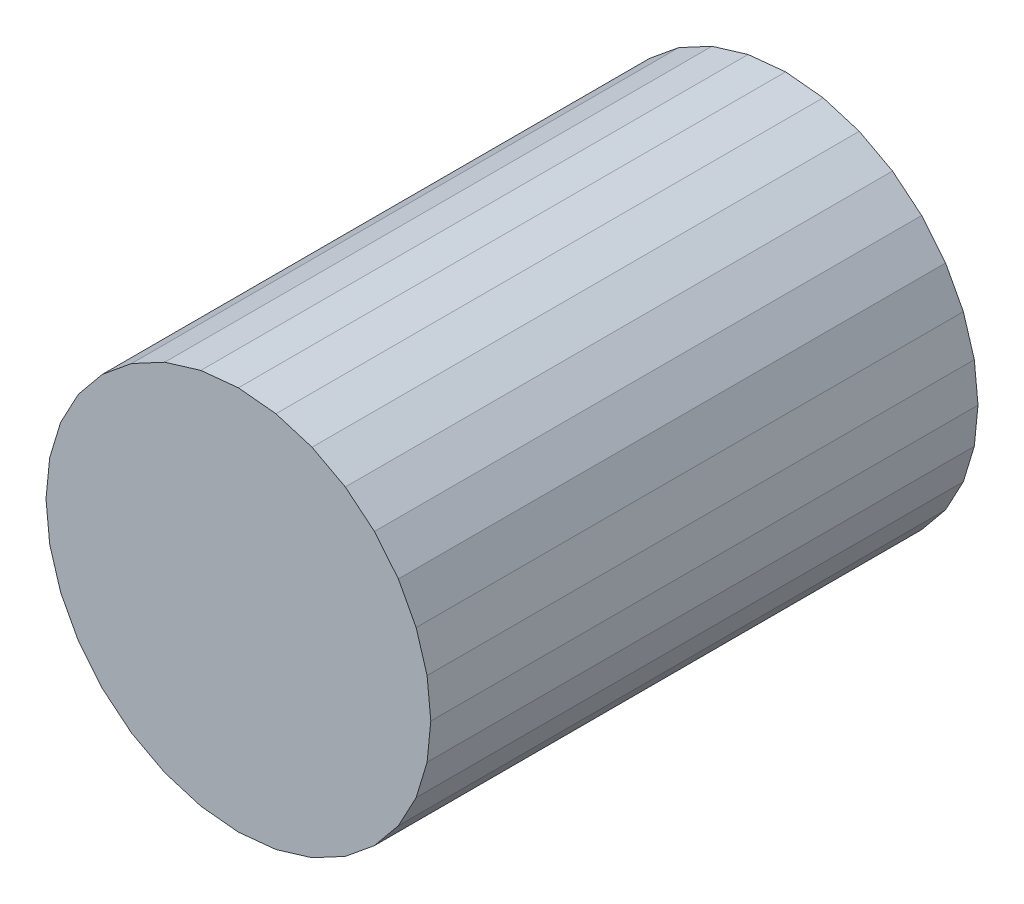
ISO-10303-21;
HEADER;
FILE_DESCRIPTION(('STEP AP214'),'2;1');
FILE_NAME('part.step','',(''),(''),'','','');
FILE_SCHEMA(('AUTOMOTIVE_DESIGN { 1 0 10303 214 1 1 1 1 }'));
ENDSEC;
DATA;
#1=APPLICATION_CONTEXT('core data for automotive mechanical design processes');
#2=APPLICATION_PROTOCOL_DEFINITION('international standard','automotive_design',2000,#1);
#3=PRODUCT_CONTEXT('',#1,'mechanical');
#4=PRODUCT('Part','Part','',(#3));
#5=PRODUCT_RELATED_PRODUCT_CATEGORY('part','',(#4));
#6=PRODUCT_DEFINITION_FORMATION('','',#4);
#7=PRODUCT_DEFINITION_CONTEXT('part definition',#1,'design');
#8=PRODUCT_DEFINITION('design','',#6,#7);
#9=PRODUCT_DEFINITION_SHAPE('','',#8);
#10=(LENGTH_UNIT() NAMED_UNIT(*) SI_UNIT(.MILLI.,.METRE.));
#11=(NAMED_UNIT(*) PLANE_ANGLE_UNIT() SI_UNIT($,.RADIAN.));
#12=(NAMED_UNIT(*) SI_UNIT($,.STERADIAN.) SOLID_ANGLE_UNIT());
#13=UNCERTAINTY_MEASURE_WITH_UNIT(LENGTH_MEASURE(1.E-05),#10,'distance_accuracy_value','');
#14=(GEOMETRIC_REPRESENTATION_CONTEXT(3) GLOBAL_UNCERTAINTY_ASSIGNED_CONTEXT((#13)) GLOBAL_UNIT_ASSIGNED_CONTEXT((#10,
#11,#12)) REPRESENTATION_CONTEXT('',''));
#15=CARTESIAN_POINT('',(0.,0.,0.));
#16=DIRECTION('',(0.,0.,1.));
#17=DIRECTION('',(1.,0.,0.));
#18=AXIS2_PLACEMENT_3D('',#15,#16,#17);
#19=CARTESIAN_POINT('',(1.75795686,0.,0.));
#20=DIRECTION('',(0.995184513319346,-0.098019306513244,0.));
#21=DIRECTION('',(0.098019306513244,0.995184513319346,0.));
#22=AXIS2_PLACEMENT_3D('',#19,#20,#21);
#23=PLANE('',#22);
#24=DIRECTION('',(0.,0.,1.));
#25=VECTOR('',#24,1.);
#26=CARTESIAN_POINT('',(1.7241774,-0.34296096,0.));
#27=LINE('',#26,#25);
#28=CARTESIAN_POINT('',(1.72417739999999,-0.342960959999999,0.));
#29=VERTEX_POINT('',#28);
#30=CARTESIAN_POINT('',(1.72417739999999,-0.342960959999999,5.00000016));
#31=VERTEX_POINT('',#30);
#32=EDGE_CURVE('E228',#29,#31,#27,.T.);
#33=ORIENTED_EDGE('',*,*,#32,.F.);
#34=DIRECTION('',(0.098019306513244,0.995184513319346,0.));
#35=VECTOR('',#34,1.);
#36=CARTESIAN_POINT('',(1.75795686,0.,0.));
#37=LINE('',#36,#35);
#38=CARTESIAN_POINT('',(1.75795686000001,0.,0.));
#39=VERTEX_POINT('',#38);
#40=EDGE_CURVE('E221',#29,#39,#37,.T.);
#41=ORIENTED_EDGE('',*,*,#40,.T.);
#42=DIRECTION('',(0.,0.,1.));
#43=VECTOR('',#42,1.);
#44=CARTESIAN_POINT('',(1.75795686000003,0.,0.));
#45=LINE('',#44,#43);
#46=CARTESIAN_POINT('',(1.75795686000001,0.,5.00000016));
#47=VERTEX_POINT('',#46);
#48=EDGE_CURVE('E231',#47,#39,#45,.F.);
#49=ORIENTED_EDGE('',*,*,#48,.F.);
#50=DIRECTION('',(0.098019306513244,0.995184513319346,0.));
#51=VECTOR('',#50,1.);
#52=CARTESIAN_POINT('',(1.75795686,0.,5.00000016));
#53=LINE('',#52,#51);
#54=EDGE_CURVE('E20',#47,#31,#53,.F.);
#55=ORIENTED_EDGE('',*,*,#54,.T.);
#56=EDGE_LOOP('',(#33,#41,#49,#55));
#57=FACE_BOUND('',#56,.T.);
#58=ADVANCED_FACE('F17',(#57),#23,.T.);
#59=CARTESIAN_POINT('',(1.7241774,-0.34296096,0.));
#60=DIRECTION('',(0.956940369854269,-0.290284564769082,0.));
#61=DIRECTION('',(0.290284564769082,0.956940369854269,0.));
#62=AXIS2_PLACEMENT_3D('',#59,#60,#61);
#63=PLANE('',#62);
#64=DIRECTION('',(0.,0.,1.));
#65=VECTOR('',#64,1.);
#66=CARTESIAN_POINT('',(1.6241395,-0.67274186,0.));
#67=LINE('',#66,#65);
#68=CARTESIAN_POINT('',(1.6241394999999,-0.67274185999997,0.));
#69=VERTEX_POINT('',#68);
#70=CARTESIAN_POINT('',(1.6241394999999,-0.67274185999997,5.00000016));
#71=VERTEX_POINT('',#70);
#72=EDGE_CURVE('E252',#69,#71,#67,.T.);
#73=ORIENTED_EDGE('',*,*,#72,.F.);
#74=DIRECTION('',(0.290284564769082,0.956940369854269,0.));
#75=VECTOR('',#74,1.);
#76=CARTESIAN_POINT('',(1.7241774,-0.34296096,0.));
#77=LINE('',#76,#75);
#78=EDGE_CURVE('E241',#69,#29,#77,.T.);
#79=ORIENTED_EDGE('',*,*,#78,.T.);
#80=ORIENTED_EDGE('',*,*,#32,.T.);
#81=DIRECTION('',(0.290284564769082,0.956940369854269,0.));
#82=VECTOR('',#81,1.);
#83=CARTESIAN_POINT('',(1.7241774,-0.34296096,5.00000016));
#84=LINE('',#83,#82);
#85=EDGE_CURVE('E234',#31,#71,#84,.F.);
#86=ORIENTED_EDGE('',*,*,#85,.T.);
#87=EDGE_LOOP('',(#73,#79,#80,#86));
#88=FACE_BOUND('',#87,.T.);
#89=ADVANCED_FACE('F243',(#88),#63,.T.);
#90=CARTESIAN_POINT('',(1.7241774,0.34296096,0.));
#91=DIRECTION('',(0.995184513319346,0.098019306513244,0.));
#92=DIRECTION('',(-0.098019306513244,0.995184513319346,0.));
#93=AXIS2_PLACEMENT_3D('',#90,#91,#92);
#94=PLANE('',#93);
#95=ORIENTED_EDGE('',*,*,#48,.T.);
#96=DIRECTION('',(-0.098019306513244,0.995184513319346,0.));
#97=VECTOR('',#96,1.);
#98=CARTESIAN_POINT('',(1.7241774,0.34296096,0.));
#99=LINE('',#98,#97);
#100=CARTESIAN_POINT('',(1.72417740000005,0.342960960000015,0.));
#101=VERTEX_POINT('',#100);
#102=EDGE_CURVE('E250',#39,#101,#99,.T.);
#103=ORIENTED_EDGE('',*,*,#102,.T.);
#104=DIRECTION('',(0.,0.,1.));
#105=VECTOR('',#104,1.);
#106=CARTESIAN_POINT('',(1.7241774000002,0.342960960000061,0.));
#107=LINE('',#106,#105);
#108=CARTESIAN_POINT('',(1.72417740000005,0.342960960000014,5.00000016));
#109=VERTEX_POINT('',#108);
#110=EDGE_CURVE('E261',#109,#101,#107,.F.);
#111=ORIENTED_EDGE('',*,*,#110,.F.);
#112=DIRECTION('',(-0.098019306513244,0.995184513319346,0.));
#113=VECTOR('',#112,1.);
#114=CARTESIAN_POINT('',(1.7241774,0.34296096,5.00000016));
#115=LINE('',#114,#113);
#116=EDGE_CURVE('E247',#109,#47,#115,.F.);
#117=ORIENTED_EDGE('',*,*,#116,.T.);
#118=EDGE_LOOP('',(#95,#103,#111,#117));
#119=FACE_BOUND('',#118,.T.);
#120=ADVANCED_FACE('F542',(#119),#94,.T.);
#121=CARTESIAN_POINT('',(1.6241395,-0.67274186,0.));
#122=DIRECTION('',(0.881922687598857,-0.471394074101923,0.));
#123=DIRECTION('',(0.471394074101923,0.881922687598857,0.));
#124=AXIS2_PLACEMENT_3D('',#121,#122,#123);
#125=PLANE('',#124);
#126=DIRECTION('',(0.,0.,1.));
#127=VECTOR('',#126,1.);
#128=CARTESIAN_POINT('',(1.46168872,-0.9766681,0.));
#129=LINE('',#128,#127);
#130=CARTESIAN_POINT('',(1.46168872000002,-0.976668100000013,0.));
#131=VERTEX_POINT('',#130);
#132=CARTESIAN_POINT('',(1.46168872000002,-0.976668100000012,5.00000016));
#133=VERTEX_POINT('',#132);
#134=EDGE_CURVE('E266',#131,#133,#129,.T.);
#135=ORIENTED_EDGE('',*,*,#134,.F.);
#136=DIRECTION('',(0.471394074101923,0.881922687598857,0.));
#137=VECTOR('',#136,1.);
#138=CARTESIAN_POINT('',(1.6241395,-0.67274186,0.));
#139=LINE('',#138,#137);
#140=EDGE_CURVE('E255',#131,#69,#139,.T.);
#141=ORIENTED_EDGE('',*,*,#140,.T.);
#142=ORIENTED_EDGE('',*,*,#72,.T.);
#143=DIRECTION('',(0.471394074101923,0.881922687598857,0.));
#144=VECTOR('',#143,1.);
#145=CARTESIAN_POINT('',(1.6241395,-0.67274186,5.00000016));
#146=LINE('',#145,#144);
#147=EDGE_CURVE('E237',#71,#133,#146,.F.);
#148=ORIENTED_EDGE('',*,*,#147,.T.);
#149=EDGE_LOOP('',(#135,#141,#142,#148));
#150=FACE_BOUND('',#149,.T.);
#151=ADVANCED_FACE('F539',(#150),#125,.T.);
#152=CARTESIAN_POINT('',(1.6241395,0.67274186,0.));
#153=DIRECTION('',(0.956940369854269,0.290284564769082,0.));
#154=DIRECTION('',(-0.290284564769082,0.956940369854269,0.));
#155=AXIS2_PLACEMENT_3D('',#152,#153,#154);
#156=PLANE('',#155);
#157=ORIENTED_EDGE('',*,*,#110,.T.);
#158=DIRECTION('',(-0.290284564769082,0.956940369854269,0.));
#159=VECTOR('',#158,1.);
#160=CARTESIAN_POINT('',(1.6241395,0.67274186,0.));
#161=LINE('',#160,#159);
#162=CARTESIAN_POINT('',(1.62413949999999,0.672741859999994,0.));
#163=VERTEX_POINT('',#162);
#164=EDGE_CURVE('E264',#101,#163,#161,.T.);
#165=ORIENTED_EDGE('',*,*,#164,.T.);
#166=DIRECTION('',(0.,0.,1.));
#167=VECTOR('',#166,1.);
#168=CARTESIAN_POINT('',(1.62413949999995,0.672741859999975,0.));
#169=LINE('',#168,#167);
#170=CARTESIAN_POINT('',(1.62413949999999,0.672741859999994,5.00000016));
#171=VERTEX_POINT('',#170);
#172=EDGE_CURVE('E277',#171,#163,#169,.F.);
#173=ORIENTED_EDGE('',*,*,#172,.F.);
#174=DIRECTION('',(-0.290284564769082,0.956940369854269,0.));
#175=VECTOR('',#174,1.);
#176=CARTESIAN_POINT('',(1.6241395,0.67274186,5.00000016));
#177=LINE('',#176,#175);
#178=EDGE_CURVE('E258',#171,#109,#177,.F.);
#179=ORIENTED_EDGE('',*,*,#178,.T.);
#180=EDGE_LOOP('',(#157,#165,#173,#179));
#181=FACE_BOUND('',#180,.T.);
#182=ADVANCED_FACE('F541',(#181),#156,.T.);
#183=CARTESIAN_POINT('',(1.46168872,-0.9766681,0.));
#184=DIRECTION('',(0.773009700056623,-0.63439420206869,0.));
#185=DIRECTION('',(0.63439420206869,0.773009700056623,0.));
#186=AXIS2_PLACEMENT_3D('',#183,#184,#185);
#187=PLANE('',#186);
#188=DIRECTION('',(0.,0.,1.));
#189=VECTOR('',#188,1.);
#190=CARTESIAN_POINT('',(1.2430633,-1.2430633,0.));
#191=LINE('',#190,#189);
#192=CARTESIAN_POINT('',(1.24306330000001,-1.24306330000001,0.));
#193=VERTEX_POINT('',#192);
#194=CARTESIAN_POINT('',(1.24306330000001,-1.24306330000001,5.00000016));
#195=VERTEX_POINT('',#194);
#196=EDGE_CURVE('E282',#193,#195,#191,.T.);
#197=ORIENTED_EDGE('',*,*,#196,.F.);
#198=DIRECTION('',(0.63439420206869,0.773009700056623,0.));
#199=VECTOR('',#198,1.);
#200=CARTESIAN_POINT('',(1.46168872,-0.9766681,0.));
#201=LINE('',#200,#199);
#202=EDGE_CURVE('E271',#193,#131,#201,.T.);
#203=ORIENTED_EDGE('',*,*,#202,.T.);
#204=ORIENTED_EDGE('',*,*,#134,.T.);
#205=DIRECTION('',(0.63439420206869,0.773009700056623,0.));
#206=VECTOR('',#205,1.);
#207=CARTESIAN_POINT('',(1.46168872,-0.9766681,5.00000016));
#208=LINE('',#207,#206);
#209=EDGE_CURVE('E269',#133,#195,#208,.F.);
#210=ORIENTED_EDGE('',*,*,#209,.T.);
#211=EDGE_LOOP('',(#197,#203,#204,#210));
#212=FACE_BOUND('',#211,.T.);
#213=ADVANCED_FACE('F536',(#212),#187,.T.);
#214=CARTESIAN_POINT('',(1.46168872,0.9766681,0.));
#215=DIRECTION('',(0.881922687598857,0.471394074101923,0.));
#216=DIRECTION('',(-0.471394074101923,0.881922687598857,0.));
#217=AXIS2_PLACEMENT_3D('',#214,#215,#216);
#218=PLANE('',#217);
#219=ORIENTED_EDGE('',*,*,#172,.T.);
#220=DIRECTION('',(-0.471394074101923,0.881922687598857,0.));
#221=VECTOR('',#220,1.);
#222=CARTESIAN_POINT('',(1.46168872,0.9766681,0.));
#223=LINE('',#222,#221);
#224=CARTESIAN_POINT('',(1.46168872,0.976668099999996,0.));
#225=VERTEX_POINT('',#224);
#226=EDGE_CURVE('E280',#163,#225,#223,.T.);
#227=ORIENTED_EDGE('',*,*,#226,.T.);
#228=DIRECTION('',(0.,0.,1.));
#229=VECTOR('',#228,1.);
#230=CARTESIAN_POINT('',(1.46168871999998,0.976668099999985,0.));
#231=LINE('',#230,#229);
#232=CARTESIAN_POINT('',(1.46168872,0.976668099999996,5.00000016));
#233=VERTEX_POINT('',#232);
#234=EDGE_CURVE('E293',#233,#225,#231,.F.);
#235=ORIENTED_EDGE('',*,*,#234,.F.);
#236=DIRECTION('',(-0.471394074101923,0.881922687598857,0.));
#237=VECTOR('',#236,1.);
#238=CARTESIAN_POINT('',(1.46168872,0.9766681,5.00000016));
#239=LINE('',#238,#237);
#240=EDGE_CURVE('E274',#233,#171,#239,.F.);
#241=ORIENTED_EDGE('',*,*,#240,.T.);
#242=EDGE_LOOP('',(#219,#227,#235,#241));
#243=FACE_BOUND('',#242,.T.);
#244=ADVANCED_FACE('F634',(#243),#218,.T.);
#245=CARTESIAN_POINT('',(1.2430633,-1.2430633,0.));
#246=DIRECTION('',(0.63439420206869,-0.773009700056623,0.));
#247=DIRECTION('',(0.773009700056623,0.63439420206869,0.));
#248=AXIS2_PLACEMENT_3D('',#245,#246,#247);
#249=PLANE('',#248);
#250=DIRECTION('',(0.,0.,1.));
#251=VECTOR('',#250,1.);
#252=CARTESIAN_POINT('',(0.9766681,-1.46168872,0.));
#253=LINE('',#252,#251);
#254=CARTESIAN_POINT('',(0.976668099999992,-1.46168871999999,0.));
#255=VERTEX_POINT('',#254);
#256=CARTESIAN_POINT('',(0.976668099999992,-1.46168871999999,5.00000016));
#257=VERTEX_POINT('',#256);
#258=EDGE_CURVE('E298',#255,#257,#253,.T.);
#259=ORIENTED_EDGE('',*,*,#258,.F.);
#260=DIRECTION('',(0.773009700056623,0.63439420206869,0.));
#261=VECTOR('',#260,1.);
#262=CARTESIAN_POINT('',(1.2430633,-1.2430633,0.));
#263=LINE('',#262,#261);
#264=EDGE_CURVE('E287',#255,#193,#263,.T.);
#265=ORIENTED_EDGE('',*,*,#264,.T.);
#266=ORIENTED_EDGE('',*,*,#196,.T.);
#267=DIRECTION('',(0.773009700056623,0.63439420206869,0.));
#268=VECTOR('',#267,1.);
#269=CARTESIAN_POINT('',(1.2430633,-1.2430633,5.00000016));
#270=LINE('',#269,#268);
#271=EDGE_CURVE('E285',#195,#257,#270,.F.);
#272=ORIENTED_EDGE('',*,*,#271,.T.);
#273=EDGE_LOOP('',(#259,#265,#266,#272));
#274=FACE_BOUND('',#273,.T.);
#275=ADVANCED_FACE('F533',(#274),#249,.T.);
#276=CARTESIAN_POINT('',(1.2430633,1.2430633,0.));
#277=DIRECTION('',(0.773009700056623,0.63439420206869,0.));
#278=DIRECTION('',(-0.63439420206869,0.773009700056623,0.));
#279=AXIS2_PLACEMENT_3D('',#276,#277,#278);
#280=PLANE('',#279);
#281=ORIENTED_EDGE('',*,*,#234,.T.);
#282=DIRECTION('',(-0.63439420206869,0.773009700056623,0.));
#283=VECTOR('',#282,1.);
#284=CARTESIAN_POINT('',(1.2430633,1.2430633,0.));
#285=LINE('',#284,#283);
#286=CARTESIAN_POINT('',(1.2430633,1.2430633,0.));
#287=VERTEX_POINT('',#286);
#288=EDGE_CURVE('E296',#225,#287,#285,.T.);
#289=ORIENTED_EDGE('',*,*,#288,.T.);
#290=DIRECTION('',(0.,0.,1.));
#291=VECTOR('',#290,1.);
#292=CARTESIAN_POINT('',(1.24306330000002,1.24306330000002,0.));
#293=LINE('',#292,#291);
#294=CARTESIAN_POINT('',(1.2430633,1.2430633,5.00000016));
#295=VERTEX_POINT('',#294);
#296=EDGE_CURVE('E309',#295,#287,#293,.F.);
#297=ORIENTED_EDGE('',*,*,#296,.F.);
#298=DIRECTION('',(-0.63439420206869,0.773009700056623,0.));
#299=VECTOR('',#298,1.);
#300=CARTESIAN_POINT('',(1.2430633,1.2430633,5.00000016));
#301=LINE('',#300,#299);
#302=EDGE_CURVE('E290',#295,#233,#301,.F.);
#303=ORIENTED_EDGE('',*,*,#302,.T.);
#304=EDGE_LOOP('',(#281,#289,#297,#303));
#305=FACE_BOUND('',#304,.T.);
#306=ADVANCED_FACE('F628',(#305),#280,.T.);
#307=CARTESIAN_POINT('',(0.9766681,-1.46168872,0.));
#308=DIRECTION('',(0.471394074101923,-0.881922687598857,0.));
#309=DIRECTION('',(0.881922687598857,0.471394074101923,0.));
#310=AXIS2_PLACEMENT_3D('',#307,#308,#309);
#311=PLANE('',#310);
#312=DIRECTION('',(0.,0.,1.));
#313=VECTOR('',#312,1.);
#314=CARTESIAN_POINT('',(0.67274186,-1.6241395,0.));
#315=LINE('',#314,#313);
#316=CARTESIAN_POINT('',(0.672741859999988,-1.62413949999998,0.));
#317=VERTEX_POINT('',#316);
#318=CARTESIAN_POINT('',(0.672741859999988,-1.62413949999998,5.00000016));
#319=VERTEX_POINT('',#318);
#320=EDGE_CURVE('E314',#317,#319,#315,.T.);
#321=ORIENTED_EDGE('',*,*,#320,.F.);
#322=DIRECTION('',(0.881922687598857,0.471394074101923,0.));
#323=VECTOR('',#322,1.);
#324=CARTESIAN_POINT('',(0.9766681,-1.46168872,0.));
#325=LINE('',#324,#323);
#326=EDGE_CURVE('E303',#317,#255,#325,.T.);
#327=ORIENTED_EDGE('',*,*,#326,.T.);
#328=ORIENTED_EDGE('',*,*,#258,.T.);
#329=DIRECTION('',(0.881922687598857,0.471394074101923,0.));
#330=VECTOR('',#329,1.);
#331=CARTESIAN_POINT('',(0.9766681,-1.46168872,5.00000016));
#332=LINE('',#331,#330);
#333=EDGE_CURVE('E301',#257,#319,#332,.F.);
#334=ORIENTED_EDGE('',*,*,#333,.T.);
#335=EDGE_LOOP('',(#321,#327,#328,#334));
#336=FACE_BOUND('',#335,.T.);
#337=ADVANCED_FACE('F531',(#336),#311,.T.);
#338=CARTESIAN_POINT('',(0.9766681,1.46168872,0.));
#339=DIRECTION('',(0.63439420206869,0.773009700056623,0.));
#340=DIRECTION('',(-0.773009700056623,0.63439420206869,0.));
#341=AXIS2_PLACEMENT_3D('',#338,#339,#340);
#342=PLANE('',#341);
#343=ORIENTED_EDGE('',*,*,#296,.T.);
#344=DIRECTION('',(-0.773009700056623,0.63439420206869,0.));
#345=VECTOR('',#344,1.);
#346=CARTESIAN_POINT('',(0.9766681,1.46168872,0.));
#347=LINE('',#346,#345);
#348=CARTESIAN_POINT('',(0.976668100000006,1.46168872000001,0.));
#349=VERTEX_POINT('',#348);
#350=EDGE_CURVE('E312',#287,#349,#347,.T.);
#351=ORIENTED_EDGE('',*,*,#350,.T.);
#352=DIRECTION('',(0.,0.,1.));
#353=VECTOR('',#352,1.);
#354=CARTESIAN_POINT('',(0.976668100000024,1.46168872000005,0.));
#355=LINE('',#354,#353);
#356=CARTESIAN_POINT('',(0.976668100000007,1.46168872000001,5.00000016));
#357=VERTEX_POINT('',#356);
#358=EDGE_CURVE('E325',#357,#349,#355,.F.);
#359=ORIENTED_EDGE('',*,*,#358,.F.);
#360=DIRECTION('',(-0.773009700056623,0.63439420206869,0.));
#361=VECTOR('',#360,1.);
#362=CARTESIAN_POINT('',(0.9766681,1.46168872,5.00000016));
#363=LINE('',#362,#361);
#364=EDGE_CURVE('E306',#357,#295,#363,.F.);
#365=ORIENTED_EDGE('',*,*,#364,.T.);
#366=EDGE_LOOP('',(#343,#351,#359,#365));
#367=FACE_BOUND('',#366,.T.);
#368=ADVANCED_FACE('F622',(#367),#342,.T.);
#369=CARTESIAN_POINT('',(0.67274186,-1.6241395,0.));
#370=DIRECTION('',(0.290284564767888,-0.956940369854631,0.));
#371=DIRECTION('',(0.956940369854631,0.290284564767888,0.));
#372=AXIS2_PLACEMENT_3D('',#369,#370,#371);
#373=PLANE('',#372);
#374=DIRECTION('',(0.,0.,1.));
#375=VECTOR('',#374,1.);
#376=CARTESIAN_POINT('',(0.34296096,-1.7241774,0.));
#377=LINE('',#376,#375);
#378=CARTESIAN_POINT('',(0.342960959999969,-1.7241773999999,0.));
#379=VERTEX_POINT('',#378);
#380=CARTESIAN_POINT('',(0.342960959999969,-1.7241773999999,5.00000016));
#381=VERTEX_POINT('',#380);
#382=EDGE_CURVE('E330',#379,#381,#377,.T.);
#383=ORIENTED_EDGE('',*,*,#382,.F.);
#384=DIRECTION('',(0.956940369854631,0.290284564767888,0.));
#385=VECTOR('',#384,1.);
#386=CARTESIAN_POINT('',(0.67274186,-1.6241395,0.));
#387=LINE('',#386,#385);
#388=EDGE_CURVE('E319',#379,#317,#387,.T.);
#389=ORIENTED_EDGE('',*,*,#388,.T.);
#390=ORIENTED_EDGE('',*,*,#320,.T.);
#391=DIRECTION('',(0.956940369854631,0.290284564767888,0.));
#392=VECTOR('',#391,1.);
#393=CARTESIAN_POINT('',(0.67274186,-1.6241395,5.00000016));
#394=LINE('',#393,#392);
#395=EDGE_CURVE('E317',#319,#381,#394,.F.);
#396=ORIENTED_EDGE('',*,*,#395,.T.);
#397=EDGE_LOOP('',(#383,#389,#390,#396));
#398=FACE_BOUND('',#397,.T.);
#399=ADVANCED_FACE('F525',(#398),#373,.T.);
#400=CARTESIAN_POINT('',(0.67274186,1.6241395,0.));
#401=DIRECTION('',(0.471394074101923,0.881922687598857,0.));
#402=DIRECTION('',(-0.881922687598857,0.471394074101923,0.));
#403=AXIS2_PLACEMENT_3D('',#400,#401,#402);
#404=PLANE('',#403);
#405=ORIENTED_EDGE('',*,*,#358,.T.);
#406=DIRECTION('',(-0.881922687598857,0.471394074101923,0.));
#407=VECTOR('',#406,1.);
#408=CARTESIAN_POINT('',(0.67274186,1.6241395,0.));
#409=LINE('',#408,#407);
#410=CARTESIAN_POINT('',(0.672741859999984,1.62413949999995,0.));
#411=VERTEX_POINT('',#410);
#412=EDGE_CURVE('E328',#349,#411,#409,.T.);
#413=ORIENTED_EDGE('',*,*,#412,.T.);
#414=DIRECTION('',(0.,0.,1.));
#415=VECTOR('',#414,1.);
#416=CARTESIAN_POINT('',(0.672741859999939,1.6241394999998,0.));
#417=LINE('',#416,#415);
#418=CARTESIAN_POINT('',(0.672741859999983,1.62413949999995,5.00000016));
#419=VERTEX_POINT('',#418);
#420=EDGE_CURVE('E341',#419,#411,#417,.F.);
#421=ORIENTED_EDGE('',*,*,#420,.F.);
#422=DIRECTION('',(-0.881922687598857,0.471394074101923,0.));
#423=VECTOR('',#422,1.);
#424=CARTESIAN_POINT('',(0.67274186,1.6241395,5.00000016));
#425=LINE('',#424,#423);
#426=EDGE_CURVE('E322',#419,#357,#425,.F.);
#427=ORIENTED_EDGE('',*,*,#426,.T.);
#428=EDGE_LOOP('',(#405,#413,#421,#427));
#429=FACE_BOUND('',#428,.T.);
#430=ADVANCED_FACE('F616',(#429),#404,.T.);
#431=CARTESIAN_POINT('',(0.34296096,-1.7241774,0.));
#432=DIRECTION('',(0.098019306513244,-0.995184513319346,0.));
#433=DIRECTION('',(0.995184513319346,0.098019306513244,0.));
#434=AXIS2_PLACEMENT_3D('',#431,#432,#433);
#435=PLANE('',#434);
#436=DIRECTION('',(0.,0.,1.));
#437=VECTOR('',#436,1.);
#438=CARTESIAN_POINT('',(0.,-1.75795686,0.));
#439=LINE('',#438,#437);
#440=CARTESIAN_POINT('',(0.,-1.75795686000001,0.));
#441=VERTEX_POINT('',#440);
#442=CARTESIAN_POINT('',(0.,-1.75795686000001,5.00000016));
#443=VERTEX_POINT('',#442);
#444=EDGE_CURVE('E346',#441,#443,#439,.T.);
#445=ORIENTED_EDGE('',*,*,#444,.F.);
#446=DIRECTION('',(0.995184513319346,0.098019306513244,0.));
#447=VECTOR('',#446,1.);
#448=CARTESIAN_POINT('',(0.34296096,-1.7241774,0.));
#449=LINE('',#448,#447);
#450=EDGE_CURVE('E335',#441,#379,#449,.T.);
#451=ORIENTED_EDGE('',*,*,#450,.T.);
#452=ORIENTED_EDGE('',*,*,#382,.T.);
#453=DIRECTION('',(0.995184513319346,0.098019306513244,0.));
#454=VECTOR('',#453,1.);
#455=CARTESIAN_POINT('',(0.34296096,-1.7241774,5.00000016));
#456=LINE('',#455,#454);
#457=EDGE_CURVE('E333',#381,#443,#456,.F.);
#458=ORIENTED_EDGE('',*,*,#457,.T.);
#459=EDGE_LOOP('',(#445,#451,#452,#458));
#460=FACE_BOUND('',#459,.T.);
#461=ADVANCED_FACE('F522',(#460),#435,.T.);
#462=CARTESIAN_POINT('',(0.34296096,1.7241774,0.));
#463=DIRECTION('',(0.290284564769082,0.956940369854269,0.));
#464=DIRECTION('',(-0.956940369854269,0.290284564769082,0.));
#465=AXIS2_PLACEMENT_3D('',#462,#463,#464);
#466=PLANE('',#465);
#467=ORIENTED_EDGE('',*,*,#420,.T.);
#468=DIRECTION('',(-0.956940369854269,0.290284564769082,0.));
#469=VECTOR('',#468,1.);
#470=CARTESIAN_POINT('',(0.34296096,1.7241774,0.));
#471=LINE('',#470,#469);
#472=CARTESIAN_POINT('',(0.34296096,1.7241774,0.));
#473=VERTEX_POINT('',#472);
#474=EDGE_CURVE('E344',#411,#473,#471,.T.);
#475=ORIENTED_EDGE('',*,*,#474,.T.);
#476=DIRECTION('',(0.,0.,1.));
#477=VECTOR('',#476,1.);
#478=CARTESIAN_POINT('',(0.34296096,1.7241774,0.));
#479=LINE('',#478,#477);
#480=CARTESIAN_POINT('',(0.34296096,1.7241774,5.00000016));
#481=VERTEX_POINT('',#480);
#482=EDGE_CURVE('E357',#481,#473,#479,.F.);
#483=ORIENTED_EDGE('',*,*,#482,.F.);
#484=DIRECTION('',(-0.956940369854269,0.290284564769082,0.));
#485=VECTOR('',#484,1.);
#486=CARTESIAN_POINT('',(0.34296096,1.7241774,5.00000016));
#487=LINE('',#486,#485);
#488=EDGE_CURVE('E338',#481,#419,#487,.F.);
#489=ORIENTED_EDGE('',*,*,#488,.T.);
#490=EDGE_LOOP('',(#467,#475,#483,#489));
#491=FACE_BOUND('',#490,.T.);
#492=ADVANCED_FACE('F610',(#491),#466,.T.);
#493=CARTESIAN_POINT('',(0.,-1.75795686,0.));
#494=DIRECTION('',(-0.098019306513244,-0.995184513319346,0.));
#495=DIRECTION('',(0.995184513319346,-0.098019306513244,0.));
#496=AXIS2_PLACEMENT_3D('',#493,#494,#495);
#497=PLANE('',#496);
#498=DIRECTION('',(0.,0.,1.));
#499=VECTOR('',#498,1.);
#500=CARTESIAN_POINT('',(-0.34296096,-1.7241774,0.));
#501=LINE('',#500,#499);
#502=CARTESIAN_POINT('',(-0.342960959999999,-1.72417739999999,0.));
#503=VERTEX_POINT('',#502);
#504=CARTESIAN_POINT('',(-0.342960959999999,-1.72417739999999,5.00000016));
#505=VERTEX_POINT('',#504);
#506=EDGE_CURVE('E362',#503,#505,#501,.T.);
#507=ORIENTED_EDGE('',*,*,#506,.F.);
#508=DIRECTION('',(0.995184513319346,-0.098019306513244,0.));
#509=VECTOR('',#508,1.);
#510=CARTESIAN_POINT('',(0.,-1.75795686,0.));
#511=LINE('',#510,#509);
#512=EDGE_CURVE('E351',#503,#441,#511,.T.);
#513=ORIENTED_EDGE('',*,*,#512,.T.);
#514=ORIENTED_EDGE('',*,*,#444,.T.);
#515=DIRECTION('',(0.995184513319346,-0.098019306513244,0.));
#516=VECTOR('',#515,1.);
#517=CARTESIAN_POINT('',(0.,-1.75795686,5.00000016));
#518=LINE('',#517,#516);
#519=EDGE_CURVE('E349',#443,#505,#518,.F.);
#520=ORIENTED_EDGE('',*,*,#519,.T.);
#521=EDGE_LOOP('',(#507,#513,#514,#520));
#522=FACE_BOUND('',#521,.T.);
#523=ADVANCED_FACE('F520',(#522),#497,.T.);
#524=CARTESIAN_POINT('',(0.,1.75795686,0.));
#525=DIRECTION('',(0.0980193065131747,0.995184513319352,0.));
#526=DIRECTION('',(-0.995184513319352,0.0980193065131747,0.));
#527=AXIS2_PLACEMENT_3D('',#524,#525,#526);
#528=PLANE('',#527);
#529=ORIENTED_EDGE('',*,*,#482,.T.);
#530=DIRECTION('',(-0.995184513319352,0.0980193065131747,0.));
#531=VECTOR('',#530,1.);
#532=CARTESIAN_POINT('',(0.,1.75795686,0.));
#533=LINE('',#532,#531);
#534=CARTESIAN_POINT('',(0.,1.75795686,0.));
#535=VERTEX_POINT('',#534);
#536=EDGE_CURVE('E360',#473,#535,#533,.T.);
#537=ORIENTED_EDGE('',*,*,#536,.T.);
#538=DIRECTION('',(0.,0.,1.));
#539=VECTOR('',#538,1.);
#540=CARTESIAN_POINT('',(0.,1.75795686,0.));
#541=LINE('',#540,#539);
#542=CARTESIAN_POINT('',(0.,1.75795686,5.00000016));
#543=VERTEX_POINT('',#542);
#544=EDGE_CURVE('E373',#543,#535,#541,.F.);
#545=ORIENTED_EDGE('',*,*,#544,.F.);
#546=DIRECTION('',(-0.995184513319352,0.0980193065131747,0.));
#547=VECTOR('',#546,1.);
#548=CARTESIAN_POINT('',(0.,1.75795686,5.00000016));
#549=LINE('',#548,#547);
#550=EDGE_CURVE('E354',#543,#481,#549,.F.);
#551=ORIENTED_EDGE('',*,*,#550,.T.);
#552=EDGE_LOOP('',(#529,#537,#545,#551));
#553=FACE_BOUND('',#552,.T.);
#554=ADVANCED_FACE('F604',(#553),#528,.T.);
#555=CARTESIAN_POINT('',(-0.34296096,-1.7241774,0.));
#556=DIRECTION('',(-0.290284564767888,-0.956940369854631,0.));
#557=DIRECTION('',(0.956940369854631,-0.290284564767888,0.));
#558=AXIS2_PLACEMENT_3D('',#555,#556,#557);
#559=PLANE('',#558);
#560=DIRECTION('',(0.,0.,1.));
#561=VECTOR('',#560,1.);
#562=CARTESIAN_POINT('',(-0.67274186,-1.6241395,0.));
#563=LINE('',#562,#561);
#564=CARTESIAN_POINT('',(-0.672741860000031,-1.6241395000001,0.));
#565=VERTEX_POINT('',#564);
#566=CARTESIAN_POINT('',(-0.672741860000031,-1.6241395000001,5.00000016));
#567=VERTEX_POINT('',#566);
#568=EDGE_CURVE('E378',#565,#567,#563,.T.);
#569=ORIENTED_EDGE('',*,*,#568,.F.);
#570=DIRECTION('',(0.956940369854631,-0.290284564767888,0.));
#571=VECTOR('',#570,1.);
#572=CARTESIAN_POINT('',(-0.34296096,-1.7241774,0.));
#573=LINE('',#572,#571);
#574=EDGE_CURVE('E367',#565,#503,#573,.T.);
#575=ORIENTED_EDGE('',*,*,#574,.T.);
#576=ORIENTED_EDGE('',*,*,#506,.T.);
#577=DIRECTION('',(0.956940369854631,-0.290284564767888,0.));
#578=VECTOR('',#577,1.);
#579=CARTESIAN_POINT('',(-0.34296096,-1.7241774,5.00000016));
#580=LINE('',#579,#578);
#581=EDGE_CURVE('E365',#505,#567,#580,.F.);
#582=ORIENTED_EDGE('',*,*,#581,.T.);
#583=EDGE_LOOP('',(#569,#575,#576,#582));
#584=FACE_BOUND('',#583,.T.);
#585=ADVANCED_FACE('F513',(#584),#559,.T.);
#586=CARTESIAN_POINT('',(-0.34296096,1.7241774,0.));
#587=DIRECTION('',(-0.0980193065131747,0.995184513319352,0.));
#588=DIRECTION('',(-0.995184513319352,-0.0980193065131747,0.));
#589=AXIS2_PLACEMENT_3D('',#586,#587,#588);
#590=PLANE('',#589);
#591=ORIENTED_EDGE('',*,*,#544,.T.);
#592=DIRECTION('',(-0.995184513319352,-0.0980193065131747,0.));
#593=VECTOR('',#592,1.);
#594=CARTESIAN_POINT('',(-0.34296096,1.7241774,0.));
#595=LINE('',#594,#593);
#596=CARTESIAN_POINT('',(-0.342960960000016,1.72417740000005,0.));
#597=VERTEX_POINT('',#596);
#598=EDGE_CURVE('E376',#535,#597,#595,.T.);
#599=ORIENTED_EDGE('',*,*,#598,.T.);
#600=DIRECTION('',(0.,0.,1.));
#601=VECTOR('',#600,1.);
#602=CARTESIAN_POINT('',(-0.342960960000061,1.7241774000002,0.));
#603=LINE('',#602,#601);
#604=CARTESIAN_POINT('',(-0.342960960000017,1.72417740000005,5.00000016));
#605=VERTEX_POINT('',#604);
#606=EDGE_CURVE('E389',#605,#597,#603,.F.);
#607=ORIENTED_EDGE('',*,*,#606,.F.);
#608=DIRECTION('',(-0.995184513319352,-0.0980193065131747,0.));
#609=VECTOR('',#608,1.);
#610=CARTESIAN_POINT('',(-0.34296096,1.7241774,5.00000016));
#611=LINE('',#610,#609);
#612=EDGE_CURVE('E370',#605,#543,#611,.F.);
#613=ORIENTED_EDGE('',*,*,#612,.T.);
#614=EDGE_LOOP('',(#591,#599,#607,#613));
#615=FACE_BOUND('',#614,.T.);
#616=ADVANCED_FACE('F598',(#615),#590,.T.);
#617=CARTESIAN_POINT('',(-0.67274186,-1.6241395,0.));
#618=DIRECTION('',(-0.471394074101923,-0.881922687598857,0.));
#619=DIRECTION('',(0.881922687598857,-0.471394074101923,0.));
#620=AXIS2_PLACEMENT_3D('',#617,#618,#619);
#621=PLANE('',#620);
#622=DIRECTION('',(0.,0.,1.));
#623=VECTOR('',#622,1.);
#624=CARTESIAN_POINT('',(-0.9766681,-1.46168872,0.));
#625=LINE('',#624,#623);
#626=CARTESIAN_POINT('',(-0.976668100000012,-1.46168872000002,0.));
#627=VERTEX_POINT('',#626);
#628=CARTESIAN_POINT('',(-0.976668100000012,-1.46168872000002,5.00000016));
#629=VERTEX_POINT('',#628);
#630=EDGE_CURVE('E394',#627,#629,#625,.T.);
#631=ORIENTED_EDGE('',*,*,#630,.F.);
#632=DIRECTION('',(0.881922687598857,-0.471394074101923,0.));
#633=VECTOR('',#632,1.);
#634=CARTESIAN_POINT('',(-0.67274186,-1.6241395,0.));
#635=LINE('',#634,#633);
#636=EDGE_CURVE('E383',#627,#565,#635,.T.);
#637=ORIENTED_EDGE('',*,*,#636,.T.);
#638=ORIENTED_EDGE('',*,*,#568,.T.);
#639=DIRECTION('',(0.881922687598857,-0.471394074101923,0.));
#640=VECTOR('',#639,1.);
#641=CARTESIAN_POINT('',(-0.67274186,-1.6241395,5.00000016));
#642=LINE('',#641,#640);
#643=EDGE_CURVE('E381',#567,#629,#642,.F.);
#644=ORIENTED_EDGE('',*,*,#643,.T.);
#645=EDGE_LOOP('',(#631,#637,#638,#644));
#646=FACE_BOUND('',#645,.T.);
#647=ADVANCED_FACE('F510',(#646),#621,.T.);
#648=CARTESIAN_POINT('',(-0.67274186,1.6241395,0.));
#649=DIRECTION('',(-0.290284564769082,0.956940369854269,0.));
#650=DIRECTION('',(-0.956940369854269,-0.290284564769082,0.));
#651=AXIS2_PLACEMENT_3D('',#648,#649,#650);
#652=PLANE('',#651);
#653=ORIENTED_EDGE('',*,*,#606,.T.);
#654=DIRECTION('',(-0.956940369854269,-0.290284564769082,0.));
#655=VECTOR('',#654,1.);
#656=CARTESIAN_POINT('',(-0.67274186,1.6241395,0.));
#657=LINE('',#656,#655);
#658=CARTESIAN_POINT('',(-0.672741859999994,1.62413949999999,0.));
#659=VERTEX_POINT('',#658);
#660=EDGE_CURVE('E392',#597,#659,#657,.T.);
#661=ORIENTED_EDGE('',*,*,#660,.T.);
#662=DIRECTION('',(0.,0.,1.));
#663=VECTOR('',#662,1.);
#664=CARTESIAN_POINT('',(-0.672741859999975,1.62413949999995,0.));
#665=LINE('',#664,#663);
#666=CARTESIAN_POINT('',(-0.672741859999994,1.62413949999999,5.00000016));
#667=VERTEX_POINT('',#666);
#668=EDGE_CURVE('E405',#667,#659,#665,.F.);
#669=ORIENTED_EDGE('',*,*,#668,.F.);
#670=DIRECTION('',(-0.956940369854269,-0.290284564769082,0.));
#671=VECTOR('',#670,1.);
#672=CARTESIAN_POINT('',(-0.67274186,1.6241395,5.00000016));
#673=LINE('',#672,#671);
#674=EDGE_CURVE('E386',#667,#605,#673,.F.);
#675=ORIENTED_EDGE('',*,*,#674,.T.);
#676=EDGE_LOOP('',(#653,#661,#669,#675));
#677=FACE_BOUND('',#676,.T.);
#678=ADVANCED_FACE('F592',(#677),#652,.T.);
#679=CARTESIAN_POINT('',(-0.9766681,-1.46168872,0.));
#680=DIRECTION('',(-0.63439420206869,-0.773009700056623,0.));
#681=DIRECTION('',(0.773009700056623,-0.63439420206869,0.));
#682=AXIS2_PLACEMENT_3D('',#679,#680,#681);
#683=PLANE('',#682);
#684=DIRECTION('',(0.,0.,1.));
#685=VECTOR('',#684,1.);
#686=CARTESIAN_POINT('',(-1.2430633,-1.2430633,0.));
#687=LINE('',#686,#685);
#688=CARTESIAN_POINT('',(-1.24306330000001,-1.24306330000001,0.));
#689=VERTEX_POINT('',#688);
#690=CARTESIAN_POINT('',(-1.24306330000001,-1.24306330000001,5.00000016));
#691=VERTEX_POINT('',#690);
#692=EDGE_CURVE('E410',#689,#691,#687,.T.);
#693=ORIENTED_EDGE('',*,*,#692,.F.);
#694=DIRECTION('',(0.773009700056623,-0.63439420206869,0.));
#695=VECTOR('',#694,1.);
#696=CARTESIAN_POINT('',(-0.9766681,-1.46168872,0.));
#697=LINE('',#696,#695);
#698=EDGE_CURVE('E399',#689,#627,#697,.T.);
#699=ORIENTED_EDGE('',*,*,#698,.T.);
#700=ORIENTED_EDGE('',*,*,#630,.T.);
#701=DIRECTION('',(0.773009700056623,-0.63439420206869,0.));
#702=VECTOR('',#701,1.);
#703=CARTESIAN_POINT('',(-0.9766681,-1.46168872,5.00000016));
#704=LINE('',#703,#702);
#705=EDGE_CURVE('E397',#629,#691,#704,.F.);
#706=ORIENTED_EDGE('',*,*,#705,.T.);
#707=EDGE_LOOP('',(#693,#699,#700,#706));
#708=FACE_BOUND('',#707,.T.);
#709=ADVANCED_FACE('F508',(#708),#683,.T.);
#710=CARTESIAN_POINT('',(-0.9766681,1.46168872,0.));
#711=DIRECTION('',(-0.471394074101923,0.881922687598857,0.));
#712=DIRECTION('',(-0.881922687598857,-0.471394074101923,0.));
#713=AXIS2_PLACEMENT_3D('',#710,#711,#712);
#714=PLANE('',#713);
#715=ORIENTED_EDGE('',*,*,#668,.T.);
#716=DIRECTION('',(-0.881922687598857,-0.471394074101923,0.));
#717=VECTOR('',#716,1.);
#718=CARTESIAN_POINT('',(-0.9766681,1.46168872,0.));
#719=LINE('',#718,#717);
#720=CARTESIAN_POINT('',(-0.976668099999996,1.46168872,0.));
#721=VERTEX_POINT('',#720);
#722=EDGE_CURVE('E408',#659,#721,#719,.T.);
#723=ORIENTED_EDGE('',*,*,#722,.T.);
#724=DIRECTION('',(0.,0.,1.));
#725=VECTOR('',#724,1.);
#726=CARTESIAN_POINT('',(-0.976668099999985,1.46168871999998,0.));
#727=LINE('',#726,#725);
#728=CARTESIAN_POINT('',(-0.976668099999995,1.46168872,5.00000016));
#729=VERTEX_POINT('',#728);
#730=EDGE_CURVE('E421',#729,#721,#727,.F.);
#731=ORIENTED_EDGE('',*,*,#730,.F.);
#732=DIRECTION('',(-0.881922687598857,-0.471394074101923,0.));
#733=VECTOR('',#732,1.);
#734=CARTESIAN_POINT('',(-0.9766681,1.46168872,5.00000016));
#735=LINE('',#734,#733);
#736=EDGE_CURVE('E402',#729,#667,#735,.F.);
#737=ORIENTED_EDGE('',*,*,#736,.T.);
#738=EDGE_LOOP('',(#715,#723,#731,#737));
#739=FACE_BOUND('',#738,.T.);
#740=ADVANCED_FACE('F586',(#739),#714,.T.);
#741=CARTESIAN_POINT('',(-1.2430633,-1.2430633,0.));
#742=DIRECTION('',(-0.773009700056623,-0.63439420206869,0.));
#743=DIRECTION('',(0.63439420206869,-0.773009700056623,0.));
#744=AXIS2_PLACEMENT_3D('',#741,#742,#743);
#745=PLANE('',#744);
#746=DIRECTION('',(0.,0.,1.));
#747=VECTOR('',#746,1.);
#748=CARTESIAN_POINT('',(-1.46168872,-0.9766681,0.));
#749=LINE('',#748,#747);
#750=CARTESIAN_POINT('',(-1.46168871999999,-0.976668099999992,0.));
#751=VERTEX_POINT('',#750);
#752=CARTESIAN_POINT('',(-1.46168871999999,-0.976668099999992,5.00000016));
#753=VERTEX_POINT('',#752);
#754=EDGE_CURVE('E426',#751,#753,#749,.T.);
#755=ORIENTED_EDGE('',*,*,#754,.F.);
#756=DIRECTION('',(0.63439420206869,-0.773009700056623,0.));
#757=VECTOR('',#756,1.);
#758=CARTESIAN_POINT('',(-1.2430633,-1.2430633,0.));
#759=LINE('',#758,#757);
#760=EDGE_CURVE('E415',#751,#689,#759,.T.);
#761=ORIENTED_EDGE('',*,*,#760,.T.);
#762=ORIENTED_EDGE('',*,*,#692,.T.);
#763=DIRECTION('',(0.63439420206869,-0.773009700056623,0.));
#764=VECTOR('',#763,1.);
#765=CARTESIAN_POINT('',(-1.2430633,-1.2430633,5.00000016));
#766=LINE('',#765,#764);
#767=EDGE_CURVE('E413',#691,#753,#766,.F.);
#768=ORIENTED_EDGE('',*,*,#767,.T.);
#769=EDGE_LOOP('',(#755,#761,#762,#768));
#770=FACE_BOUND('',#769,.T.);
#771=ADVANCED_FACE('F501',(#770),#745,.T.);
#772=CARTESIAN_POINT('',(-1.2430633,1.2430633,0.));
#773=DIRECTION('',(-0.63439420206869,0.773009700056623,0.));
#774=DIRECTION('',(-0.773009700056623,-0.63439420206869,0.));
#775=AXIS2_PLACEMENT_3D('',#772,#773,#774);
#776=PLANE('',#775);
#777=ORIENTED_EDGE('',*,*,#730,.T.);
#778=DIRECTION('',(-0.773009700056623,-0.63439420206869,0.));
#779=VECTOR('',#778,1.);
#780=CARTESIAN_POINT('',(-1.2430633,1.2430633,0.));
#781=LINE('',#780,#779);
#782=CARTESIAN_POINT('',(-1.2430633,1.2430633,0.));
#783=VERTEX_POINT('',#782);
#784=EDGE_CURVE('E424',#721,#783,#781,.T.);
#785=ORIENTED_EDGE('',*,*,#784,.T.);
#786=DIRECTION('',(0.,0.,1.));
#787=VECTOR('',#786,1.);
#788=CARTESIAN_POINT('',(-1.24306330000002,1.24306330000002,0.));
#789=LINE('',#788,#787);
#790=CARTESIAN_POINT('',(-1.2430633,1.2430633,5.00000016));
#791=VERTEX_POINT('',#790);
#792=EDGE_CURVE('E437',#791,#783,#789,.F.);
#793=ORIENTED_EDGE('',*,*,#792,.F.);
#794=DIRECTION('',(-0.773009700056623,-0.63439420206869,0.));
#795=VECTOR('',#794,1.);
#796=CARTESIAN_POINT('',(-1.2430633,1.2430633,5.00000016));
#797=LINE('',#796,#795);
#798=EDGE_CURVE('E418',#791,#729,#797,.F.);
#799=ORIENTED_EDGE('',*,*,#798,.T.);
#800=EDGE_LOOP('',(#777,#785,#793,#799));
#801=FACE_BOUND('',#800,.T.);
#802=ADVANCED_FACE('F580',(#801),#776,.T.);
#803=CARTESIAN_POINT('',(-1.46168872,-0.9766681,0.));
#804=DIRECTION('',(-0.881922687598857,-0.471394074101923,0.));
#805=DIRECTION('',(0.471394074101923,-0.881922687598857,0.));
#806=AXIS2_PLACEMENT_3D('',#803,#804,#805);
#807=PLANE('',#806);
#808=DIRECTION('',(0.,0.,1.));
#809=VECTOR('',#808,1.);
#810=CARTESIAN_POINT('',(-1.6241395,-0.67274186,0.));
#811=LINE('',#810,#809);
#812=CARTESIAN_POINT('',(-1.62413949999998,-0.672741859999988,0.));
#813=VERTEX_POINT('',#812);
#814=CARTESIAN_POINT('',(-1.62413949999998,-0.672741859999988,5.00000016));
#815=VERTEX_POINT('',#814);
#816=EDGE_CURVE('E442',#813,#815,#811,.T.);
#817=ORIENTED_EDGE('',*,*,#816,.F.);
#818=DIRECTION('',(0.471394074101923,-0.881922687598857,0.));
#819=VECTOR('',#818,1.);
#820=CARTESIAN_POINT('',(-1.46168872,-0.9766681,0.));
#821=LINE('',#820,#819);
#822=EDGE_CURVE('E431',#813,#751,#821,.T.);
#823=ORIENTED_EDGE('',*,*,#822,.T.);
#824=ORIENTED_EDGE('',*,*,#754,.T.);
#825=DIRECTION('',(0.471394074101923,-0.881922687598857,0.));
#826=VECTOR('',#825,1.);
#827=CARTESIAN_POINT('',(-1.46168872,-0.9766681,5.00000016));
#828=LINE('',#827,#826);
#829=EDGE_CURVE('E429',#753,#815,#828,.F.);
#830=ORIENTED_EDGE('',*,*,#829,.T.);
#831=EDGE_LOOP('',(#817,#823,#824,#830));
#832=FACE_BOUND('',#831,.T.);
#833=ADVANCED_FACE('F498',(#832),#807,.T.);
#834=CARTESIAN_POINT('',(-1.46168872,0.9766681,0.));
#835=DIRECTION('',(-0.773009700056623,0.63439420206869,0.));
#836=DIRECTION('',(-0.63439420206869,-0.773009700056623,0.));
#837=AXIS2_PLACEMENT_3D('',#834,#835,#836);
#838=PLANE('',#837);
#839=ORIENTED_EDGE('',*,*,#792,.T.);
#840=DIRECTION('',(-0.63439420206869,-0.773009700056623,0.));
#841=VECTOR('',#840,1.);
#842=CARTESIAN_POINT('',(-1.46168872,0.9766681,0.));
#843=LINE('',#842,#841);
#844=CARTESIAN_POINT('',(-1.46168872000001,0.976668100000006,0.));
#845=VERTEX_POINT('',#844);
#846=EDGE_CURVE('E440',#783,#845,#843,.T.);
#847=ORIENTED_EDGE('',*,*,#846,.T.);
#848=DIRECTION('',(0.,0.,1.));
#849=VECTOR('',#848,1.);
#850=CARTESIAN_POINT('',(-1.46168872000005,0.976668100000024,0.));
#851=LINE('',#850,#849);
#852=CARTESIAN_POINT('',(-1.46168872000001,0.976668100000007,5.00000016));
#853=VERTEX_POINT('',#852);
#854=EDGE_CURVE('E453',#853,#845,#851,.F.);
#855=ORIENTED_EDGE('',*,*,#854,.F.);
#856=DIRECTION('',(-0.63439420206869,-0.773009700056623,0.));
#857=VECTOR('',#856,1.);
#858=CARTESIAN_POINT('',(-1.46168872,0.9766681,5.00000016));
#859=LINE('',#858,#857);
#860=EDGE_CURVE('E434',#853,#791,#859,.F.);
#861=ORIENTED_EDGE('',*,*,#860,.T.);
#862=EDGE_LOOP('',(#839,#847,#855,#861));
#863=FACE_BOUND('',#862,.T.);
#864=ADVANCED_FACE('F574',(#863),#838,.T.);
#865=CARTESIAN_POINT('',(-1.6241395,-0.67274186,0.));
#866=DIRECTION('',(-0.956940369854631,-0.290284564767888,0.));
#867=DIRECTION('',(0.290284564767888,-0.956940369854631,0.));
#868=AXIS2_PLACEMENT_3D('',#865,#866,#867);
#869=PLANE('',#868);
#870=DIRECTION('',(0.,0.,1.));
#871=VECTOR('',#870,1.);
#872=CARTESIAN_POINT('',(-1.7241774,-0.34296096,0.));
#873=LINE('',#872,#871);
#874=CARTESIAN_POINT('',(-1.7241773999999,-0.342960959999968,0.));
#875=VERTEX_POINT('',#874);
#876=CARTESIAN_POINT('',(-1.7241773999999,-0.342960959999968,5.00000016));
#877=VERTEX_POINT('',#876);
#878=EDGE_CURVE('E458',#875,#877,#873,.T.);
#879=ORIENTED_EDGE('',*,*,#878,.F.);
#880=DIRECTION('',(0.290284564767888,-0.956940369854631,0.));
#881=VECTOR('',#880,1.);
#882=CARTESIAN_POINT('',(-1.6241395,-0.67274186,0.));
#883=LINE('',#882,#881);
#884=EDGE_CURVE('E447',#875,#813,#883,.T.);
#885=ORIENTED_EDGE('',*,*,#884,.T.);
#886=ORIENTED_EDGE('',*,*,#816,.T.);
#887=DIRECTION('',(0.290284564767888,-0.956940369854631,0.));
#888=VECTOR('',#887,1.);
#889=CARTESIAN_POINT('',(-1.6241395,-0.67274186,5.00000016));
#890=LINE('',#889,#888);
#891=EDGE_CURVE('E445',#815,#877,#890,.F.);
#892=ORIENTED_EDGE('',*,*,#891,.T.);
#893=EDGE_LOOP('',(#879,#885,#886,#892));
#894=FACE_BOUND('',#893,.T.);
#895=ADVANCED_FACE('F496',(#894),#869,.T.);
#896=CARTESIAN_POINT('',(-1.6241395,0.67274186,0.));
#897=DIRECTION('',(-0.881922687598857,0.471394074101923,0.));
#898=DIRECTION('',(-0.471394074101923,-0.881922687598857,0.));
#899=AXIS2_PLACEMENT_3D('',#896,#897,#898);
#900=PLANE('',#899);
#901=ORIENTED_EDGE('',*,*,#854,.T.);
#902=DIRECTION('',(-0.471394074101923,-0.881922687598857,0.));
#903=VECTOR('',#902,1.);
#904=CARTESIAN_POINT('',(-1.6241395,0.67274186,0.));
#905=LINE('',#904,#903);
#906=CARTESIAN_POINT('',(-1.62413950000005,0.672741860000016,0.));
#907=VERTEX_POINT('',#906);
#908=EDGE_CURVE('E456',#845,#907,#905,.T.);
#909=ORIENTED_EDGE('',*,*,#908,.T.);
#910=DIRECTION('',(0.,0.,1.));
#911=VECTOR('',#910,1.);
#912=CARTESIAN_POINT('',(-1.62413950000021,0.672741860000063,0.));
#913=LINE('',#912,#911);
#914=CARTESIAN_POINT('',(-1.62413950000005,0.672741860000016,5.00000016));
#915=VERTEX_POINT('',#914);
#916=EDGE_CURVE('E464',#915,#907,#913,.F.);
#917=ORIENTED_EDGE('',*,*,#916,.F.);
#918=DIRECTION('',(-0.471394074101923,-0.881922687598857,0.));
#919=VECTOR('',#918,1.);
#920=CARTESIAN_POINT('',(-1.6241395,0.67274186,5.00000016));
#921=LINE('',#920,#919);
#922=EDGE_CURVE('E450',#915,#853,#921,.F.);
#923=ORIENTED_EDGE('',*,*,#922,.T.);
#924=EDGE_LOOP('',(#901,#909,#917,#923));
#925=FACE_BOUND('',#924,.T.);
#926=ADVANCED_FACE('F568',(#925),#900,.T.);
#927=CARTESIAN_POINT('',(-1.7241774,-0.34296096,0.));
#928=DIRECTION('',(-0.995184513319346,-0.098019306513244,0.));
#929=DIRECTION('',(0.098019306513244,-0.995184513319346,0.));
#930=AXIS2_PLACEMENT_3D('',#927,#928,#929);
#931=PLANE('',#930);
#932=DIRECTION('',(0.,0.,1.));
#933=VECTOR('',#932,1.);
#934=CARTESIAN_POINT('',(-1.75795686,0.,0.));
#935=LINE('',#934,#933);
#936=CARTESIAN_POINT('',(-1.75795686000001,0.,0.));
#937=VERTEX_POINT('',#936);
#938=CARTESIAN_POINT('',(-1.75795686000001,0.,5.00000016));
#939=VERTEX_POINT('',#938);
#940=EDGE_CURVE('E472',#937,#939,#935,.T.);
#941=ORIENTED_EDGE('',*,*,#940,.F.);
#942=DIRECTION('',(0.0980193065131685,-0.995184513319353,0.));
#943=VECTOR('',#942,1.);
#944=CARTESIAN_POINT('',(-1.75795686,0.,0.));
#945=LINE('',#944,#943);
#946=EDGE_CURVE('E467',#937,#875,#945,.T.);
#947=ORIENTED_EDGE('',*,*,#946,.T.);
#948=ORIENTED_EDGE('',*,*,#878,.T.);
#949=DIRECTION('',(0.098019306513244,-0.995184513319346,0.));
#950=VECTOR('',#949,1.);
#951=CARTESIAN_POINT('',(-1.7241774,-0.34296096,5.00000016));
#952=LINE('',#951,#950);
#953=EDGE_CURVE('E461',#877,#939,#952,.F.);
#954=ORIENTED_EDGE('',*,*,#953,.T.);
#955=EDGE_LOOP('',(#941,#947,#948,#954));
#956=FACE_BOUND('',#955,.T.);
#957=ADVANCED_FACE('F489',(#956),#931,.T.);
#958=CARTESIAN_POINT('',(-1.7241774,0.34296096,0.));
#959=DIRECTION('',(-0.956940369854631,0.290284564767888,0.));
#960=DIRECTION('',(-0.290284564767888,-0.956940369854631,0.));
#961=AXIS2_PLACEMENT_3D('',#958,#959,#960);
#962=PLANE('',#961);
#963=ORIENTED_EDGE('',*,*,#916,.T.);
#964=DIRECTION('',(-0.290284564768494,-0.956940369854447,0.));
#965=VECTOR('',#964,1.);
#966=CARTESIAN_POINT('',(-1.6241395,0.67274186,0.));
#967=LINE('',#966,#965);
#968=CARTESIAN_POINT('',(-1.72417739999999,0.342960959999999,0.));
#969=VERTEX_POINT('',#968);
#970=EDGE_CURVE('E470',#907,#969,#967,.T.);
#971=ORIENTED_EDGE('',*,*,#970,.T.);
#972=DIRECTION('',(0.,0.,1.));
#973=VECTOR('',#972,1.);
#974=CARTESIAN_POINT('',(-1.72417739999997,0.342960959999997,0.));
#975=LINE('',#974,#973);
#976=CARTESIAN_POINT('',(-1.72417739999999,0.342960959999999,5.00000016));
#977=VERTEX_POINT('',#976);
#978=EDGE_CURVE('E475',#977,#969,#975,.F.);
#979=ORIENTED_EDGE('',*,*,#978,.F.);
#980=DIRECTION('',(-0.290284564767888,-0.956940369854631,0.));
#981=VECTOR('',#980,1.);
#982=CARTESIAN_POINT('',(-1.7241774,0.34296096,5.00000016));
#983=LINE('',#982,#981);
#984=EDGE_CURVE('E34',#977,#915,#983,.F.);
#985=ORIENTED_EDGE('',*,*,#984,.T.);
#986=EDGE_LOOP('',(#963,#971,#979,#985));
#987=FACE_BOUND('',#986,.T.);
#988=ADVANCED_FACE('F562',(#987),#962,.T.);
#989=CARTESIAN_POINT('',(-1.75795686,0.,0.));
#990=DIRECTION('',(0.,0.,1.));
#991=DIRECTION('',(1.,0.,0.));
#992=AXIS2_PLACEMENT_3D('',#989,#990,#991);
#993=PLANE('',#992);
#994=ORIENTED_EDGE('',*,*,#970,.F.);
#995=ORIENTED_EDGE('',*,*,#908,.F.);
#996=ORIENTED_EDGE('',*,*,#846,.F.);
#997=ORIENTED_EDGE('',*,*,#784,.F.);
#998=ORIENTED_EDGE('',*,*,#722,.F.);
#999=ORIENTED_EDGE('',*,*,#660,.F.);
#1000=ORIENTED_EDGE('',*,*,#598,.F.);
#1001=ORIENTED_EDGE('',*,*,#536,.F.);
#1002=ORIENTED_EDGE('',*,*,#474,.F.);
#1003=ORIENTED_EDGE('',*,*,#412,.F.);
#1004=ORIENTED_EDGE('',*,*,#350,.F.);
#1005=ORIENTED_EDGE('',*,*,#288,.F.);
#1006=ORIENTED_EDGE('',*,*,#226,.F.);
#1007=ORIENTED_EDGE('',*,*,#164,.F.);
#1008=ORIENTED_EDGE('',*,*,#102,.F.);
#1009=ORIENTED_EDGE('',*,*,#40,.F.);
#1010=ORIENTED_EDGE('',*,*,#78,.F.);
#1011=ORIENTED_EDGE('',*,*,#140,.F.);
#1012=ORIENTED_EDGE('',*,*,#202,.F.);
#1013=ORIENTED_EDGE('',*,*,#264,.F.);
#1014=ORIENTED_EDGE('',*,*,#326,.F.);
#1015=ORIENTED_EDGE('',*,*,#388,.F.);
#1016=ORIENTED_EDGE('',*,*,#450,.F.);
#1017=ORIENTED_EDGE('',*,*,#512,.F.);
#1018=ORIENTED_EDGE('',*,*,#574,.F.);
#1019=ORIENTED_EDGE('',*,*,#636,.F.);
#1020=ORIENTED_EDGE('',*,*,#698,.F.);
#1021=ORIENTED_EDGE('',*,*,#760,.F.);
#1022=ORIENTED_EDGE('',*,*,#822,.F.);
#1023=ORIENTED_EDGE('',*,*,#884,.F.);
#1024=ORIENTED_EDGE('',*,*,#946,.F.);
#1025=DIRECTION('',(-0.098019306513244,-0.995184513319346,0.));
#1026=VECTOR('',#1025,1.);
#1027=CARTESIAN_POINT('',(-1.75795686,0.,0.));
#1028=LINE('',#1027,#1026);
#1029=EDGE_CURVE('E26',#969,#937,#1028,.T.);
#1030=ORIENTED_EDGE('',*,*,#1029,.F.);
#1031=EDGE_LOOP('',(#994,#995,#996,#997,#998,#999,#1000,#1001,#1002,#1003,#1004,#1005,#1006,
#1007,#1008,#1009,#1010,#1011,#1012,#1013,#1014,#1015,#1016,#1017,#1018,#1019,#1020,#1021,#1022,
#1023,#1024,#1030));
#1032=FACE_BOUND('',#1031,.T.);
#1033=ADVANCED_FACE('F485',(#1032),#993,.F.);
#1034=CARTESIAN_POINT('',(-1.75795686,0.,0.));
#1035=DIRECTION('',(-0.995184513319346,0.098019306513244,0.));
#1036=DIRECTION('',(-0.098019306513244,-0.995184513319346,0.));
#1037=AXIS2_PLACEMENT_3D('',#1034,#1035,#1036);
#1038=PLANE('',#1037);
#1039=ORIENTED_EDGE('',*,*,#978,.T.);
#1040=ORIENTED_EDGE('',*,*,#1029,.T.);
#1041=ORIENTED_EDGE('',*,*,#940,.T.);
#1042=DIRECTION('',(-0.0980193065131685,-0.995184513319353,0.));
#1043=VECTOR('',#1042,1.);
#1044=CARTESIAN_POINT('',(-1.7241774,0.34296096,5.00000016));
#1045=LINE('',#1044,#1043);
#1046=EDGE_CURVE('E11',#977,#939,#1045,.T.);
#1047=ORIENTED_EDGE('',*,*,#1046,.F.);
#1048=EDGE_LOOP('',(#1039,#1040,#1041,#1047));
#1049=FACE_BOUND('',#1048,.T.);
#1050=ADVANCED_FACE('F481',(#1049),#1038,.T.);
#1051=CARTESIAN_POINT('',(-1.75795686,0.,5.00000016));
#1052=DIRECTION('',(0.,0.,1.));
#1053=DIRECTION('',(1.,0.,0.));
#1054=AXIS2_PLACEMENT_3D('',#1051,#1052,#1053);
#1055=PLANE('',#1054);
#1056=ORIENTED_EDGE('',*,*,#984,.F.);
#1057=ORIENTED_EDGE('',*,*,#1046,.T.);
#1058=ORIENTED_EDGE('',*,*,#953,.F.);
#1059=ORIENTED_EDGE('',*,*,#891,.F.);
#1060=ORIENTED_EDGE('',*,*,#829,.F.);
#1061=ORIENTED_EDGE('',*,*,#767,.F.);
#1062=ORIENTED_EDGE('',*,*,#705,.F.);
#1063=ORIENTED_EDGE('',*,*,#643,.F.);
#1064=ORIENTED_EDGE('',*,*,#581,.F.);
#1065=ORIENTED_EDGE('',*,*,#519,.F.);
#1066=ORIENTED_EDGE('',*,*,#457,.F.);
#1067=ORIENTED_EDGE('',*,*,#395,.F.);
#1068=ORIENTED_EDGE('',*,*,#333,.F.);
#1069=ORIENTED_EDGE('',*,*,#271,.F.);
#1070=ORIENTED_EDGE('',*,*,#209,.F.);
#1071=ORIENTED_EDGE('',*,*,#147,.F.);
#1072=ORIENTED_EDGE('',*,*,#85,.F.);
#1073=ORIENTED_EDGE('',*,*,#54,.F.);
#1074=ORIENTED_EDGE('',*,*,#116,.F.);
#1075=ORIENTED_EDGE('',*,*,#178,.F.);
#1076=ORIENTED_EDGE('',*,*,#240,.F.);
#1077=ORIENTED_EDGE('',*,*,#302,.F.);
#1078=ORIENTED_EDGE('',*,*,#364,.F.);
#1079=ORIENTED_EDGE('',*,*,#426,.F.);
#1080=ORIENTED_EDGE('',*,*,#488,.F.);
#1081=ORIENTED_EDGE('',*,*,#550,.F.);
#1082=ORIENTED_EDGE('',*,*,#612,.F.);
#1083=ORIENTED_EDGE('',*,*,#674,.F.);
#1084=ORIENTED_EDGE('',*,*,#736,.F.);
#1085=ORIENTED_EDGE('',*,*,#798,.F.);
#1086=ORIENTED_EDGE('',*,*,#860,.F.);
#1087=ORIENTED_EDGE('',*,*,#922,.F.);
#1088=EDGE_LOOP('',(#1056,#1057,#1058,#1059,#1060,#1061,#1062,#1063,#1064,#1065,#1066,#1067,
#1068,#1069,#1070,#1071,#1072,#1073,#1074,#1075,#1076,#1077,#1078,#1079,#1080,#1081,#1082,#1083,
#1084,#1085,#1086,#1087));
#1089=FACE_BOUND('',#1088,.T.);
#1090=ADVANCED_FACE('F235',(#1089),#1055,.T.);
#1091=CLOSED_SHELL('',(#58,#89,#120,#151,#182,#213,#244,#275,#306,#337,#368,#399,#430,#461,#492,
#523,#554,#585,#616,#647,#678,#709,#740,#771,#802,#833,#864,#895,#926,#957,#988,#1033,#1050,#1090));
#1092=MANIFOLD_SOLID_BREP('B1',#1091);
#1093=ADVANCED_BREP_SHAPE_REPRESENTATION('',(#18,#1092),#14);
#1094=SHAPE_DEFINITION_REPRESENTATION(#9,#1093);
ENDSEC;
END-ISO-10303-21;
